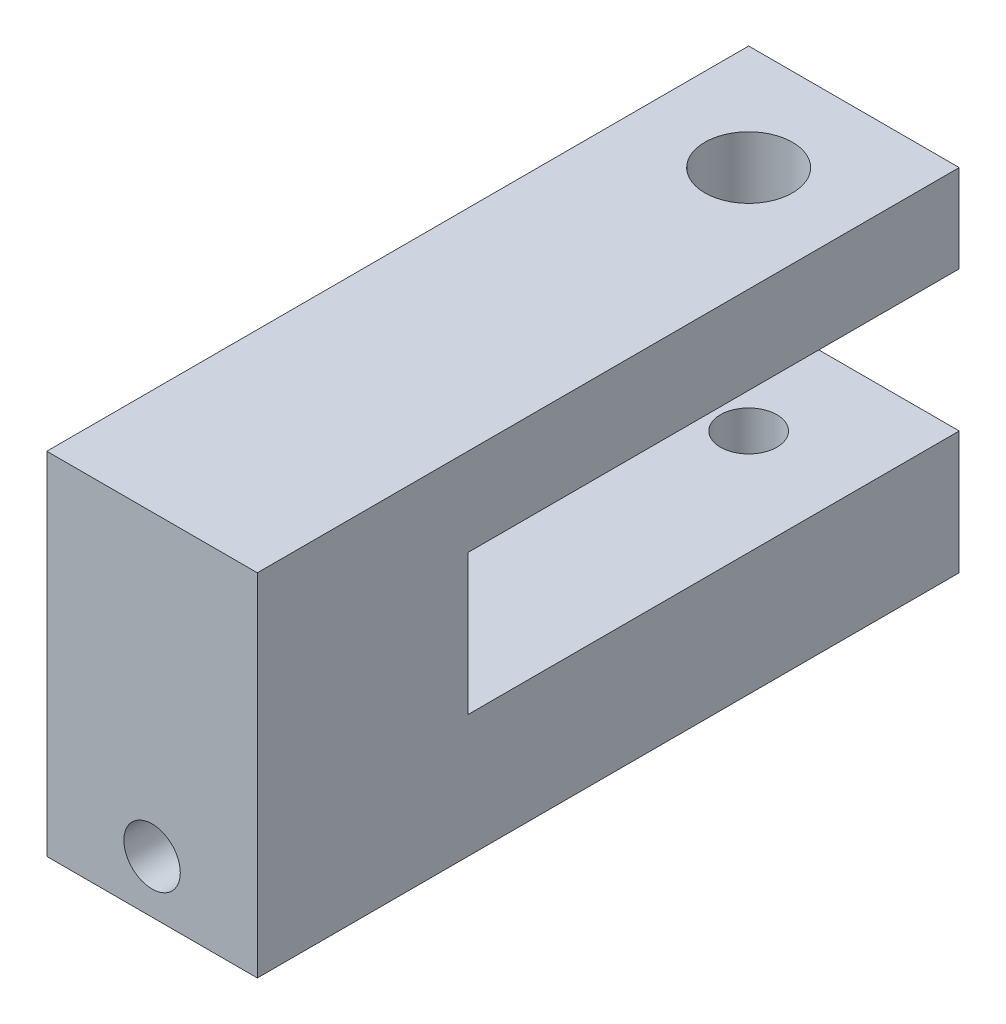
ISO-10303-21;
HEADER;
FILE_DESCRIPTION(('STEP AP214'),'2;1');
FILE_NAME('part.step','',(''),(''),'','','');
FILE_SCHEMA(('AUTOMOTIVE_DESIGN { 1 0 10303 214 1 1 1 1 }'));
ENDSEC;
DATA;
#1=APPLICATION_CONTEXT('core data for automotive mechanical design processes');
#2=APPLICATION_PROTOCOL_DEFINITION('international standard','automotive_design',2000,#1);
#3=PRODUCT_CONTEXT('',#1,'mechanical');
#4=PRODUCT('Part','Part','',(#3));
#5=PRODUCT_RELATED_PRODUCT_CATEGORY('part','',(#4));
#6=PRODUCT_DEFINITION_FORMATION('','',#4);
#7=PRODUCT_DEFINITION_CONTEXT('part definition',#1,'design');
#8=PRODUCT_DEFINITION('design','',#6,#7);
#9=PRODUCT_DEFINITION_SHAPE('','',#8);
#10=(LENGTH_UNIT() NAMED_UNIT(*) SI_UNIT(.MILLI.,.METRE.));
#11=(NAMED_UNIT(*) PLANE_ANGLE_UNIT() SI_UNIT($,.RADIAN.));
#12=(NAMED_UNIT(*) SI_UNIT($,.STERADIAN.) SOLID_ANGLE_UNIT());
#13=UNCERTAINTY_MEASURE_WITH_UNIT(LENGTH_MEASURE(1.E-05),#10,'distance_accuracy_value','');
#14=(GEOMETRIC_REPRESENTATION_CONTEXT(3) GLOBAL_UNCERTAINTY_ASSIGNED_CONTEXT((#13)) GLOBAL_UNIT_ASSIGNED_CONTEXT((#10,
#11,#12)) REPRESENTATION_CONTEXT('',''));
#15=CARTESIAN_POINT('',(0.,0.,0.));
#16=DIRECTION('',(0.,0.,1.));
#17=DIRECTION('',(1.,0.,0.));
#18=AXIS2_PLACEMENT_3D('',#15,#16,#17);
#19=CARTESIAN_POINT('',(9.525,14.2875,-9.525));
#20=DIRECTION('',(0.,-1.,0.));
#21=DIRECTION('',(0.,0.,-1.));
#22=AXIS2_PLACEMENT_3D('',#19,#20,#21);
#23=PLANE('',#22);
#24=CARTESIAN_POINT('',(0.,14.2875,0.));
#25=DIRECTION('',(0.,1.,0.));
#26=DIRECTION('',(0.,0.,1.));
#27=AXIS2_PLACEMENT_3D('',#24,#25,#26);
#28=CIRCLE('',#27,3.96874999999999);
#29=CARTESIAN_POINT('',(0.,14.2875,3.96874999999999));
#30=VERTEX_POINT('',#29);
#31=EDGE_CURVE('E190',#30,#30,#28,.T.);
#32=ORIENTED_EDGE('',*,*,#31,.F.);
#33=EDGE_LOOP('',(#32));
#34=FACE_BOUND('',#33,.T.);
#35=DIRECTION('',(0.,0.,1.));
#36=VECTOR('',#35,1.);
#37=CARTESIAN_POINT('',(-9.525,14.2875,-9.525));
#38=LINE('',#37,#36);
#39=CARTESIAN_POINT('',(-9.525,14.2875,-9.525));
#40=VERTEX_POINT('',#39);
#41=CARTESIAN_POINT('',(-9.525,14.2875,53.975));
#42=VERTEX_POINT('',#41);
#43=EDGE_CURVE('E136',#40,#42,#38,.T.);
#44=ORIENTED_EDGE('',*,*,#43,.T.);
#45=DIRECTION('',(-1.,0.,0.));
#46=VECTOR('',#45,1.);
#47=CARTESIAN_POINT('',(9.525,14.2875,53.975));
#48=LINE('',#47,#46);
#49=CARTESIAN_POINT('',(9.525,14.2875,53.975));
#50=VERTEX_POINT('',#49);
#51=EDGE_CURVE('E11',#50,#42,#48,.T.);
#52=ORIENTED_EDGE('',*,*,#51,.F.);
#53=DIRECTION('',(0.,0.,1.));
#54=VECTOR('',#53,1.);
#55=CARTESIAN_POINT('',(9.525,14.2875,-9.525));
#56=LINE('',#55,#54);
#57=CARTESIAN_POINT('',(9.525,14.2875,-9.525));
#58=VERTEX_POINT('',#57);
#59=EDGE_CURVE('E150',#58,#50,#56,.T.);
#60=ORIENTED_EDGE('',*,*,#59,.F.);
#61=DIRECTION('',(-1.,0.,0.));
#62=VECTOR('',#61,1.);
#63=CARTESIAN_POINT('',(9.525,14.2875,-9.525));
#64=LINE('',#63,#62);
#65=EDGE_CURVE('E132',#58,#40,#64,.T.);
#66=ORIENTED_EDGE('',*,*,#65,.T.);
#67=EDGE_LOOP('',(#44,#52,#60,#66));
#68=FACE_BOUND('',#67,.T.);
#69=ADVANCED_FACE('F37',(#34,#68),#23,.F.);
#70=CARTESIAN_POINT('',(9.525,14.2875,53.975));
#71=DIRECTION('',(0.,0.,-1.));
#72=DIRECTION('',(0.,1.,0.));
#73=AXIS2_PLACEMENT_3D('',#70,#71,#72);
#74=PLANE('',#73);
#75=CARTESIAN_POINT('',(0.,-12.7,53.975));
#76=DIRECTION('',(0.,0.,1.));
#77=DIRECTION('',(1.,0.,0.));
#78=AXIS2_PLACEMENT_3D('',#75,#76,#77);
#79=CIRCLE('',#78,2.55269999999999);
#80=CARTESIAN_POINT('',(2.55269999999999,-12.7,53.975));
#81=VERTEX_POINT('',#80);
#82=EDGE_CURVE('E196',#81,#81,#79,.T.);
#83=ORIENTED_EDGE('',*,*,#82,.F.);
#84=EDGE_LOOP('',(#83));
#85=FACE_BOUND('',#84,.T.);
#86=DIRECTION('',(0.,-1.,0.));
#87=VECTOR('',#86,1.);
#88=CARTESIAN_POINT('',(-9.525,14.2875,53.975));
#89=LINE('',#88,#87);
#90=CARTESIAN_POINT('',(-9.525,-17.4625,53.975));
#91=VERTEX_POINT('',#90);
#92=EDGE_CURVE('E139',#42,#91,#89,.T.);
#93=ORIENTED_EDGE('',*,*,#92,.T.);
#94=DIRECTION('',(-1.,0.,0.));
#95=VECTOR('',#94,1.);
#96=CARTESIAN_POINT('',(9.525,-17.4625,53.975));
#97=LINE('',#96,#95);
#98=CARTESIAN_POINT('',(9.525,-17.4625,53.975));
#99=VERTEX_POINT('',#98);
#100=EDGE_CURVE('E46',#99,#91,#97,.T.);
#101=ORIENTED_EDGE('',*,*,#100,.F.);
#102=DIRECTION('',(0.,-1.,0.));
#103=VECTOR('',#102,1.);
#104=CARTESIAN_POINT('',(9.525,14.2875,53.975));
#105=LINE('',#104,#103);
#106=EDGE_CURVE('E98',#50,#99,#105,.T.);
#107=ORIENTED_EDGE('',*,*,#106,.F.);
#108=ORIENTED_EDGE('',*,*,#51,.T.);
#109=EDGE_LOOP('',(#93,#101,#107,#108));
#110=FACE_BOUND('',#109,.T.);
#111=ADVANCED_FACE('F202',(#85,#110),#74,.F.);
#112=CARTESIAN_POINT('',(9.525,-17.4625,53.975));
#113=DIRECTION('',(0.,1.,0.));
#114=DIRECTION('',(0.,0.,1.));
#115=AXIS2_PLACEMENT_3D('',#112,#113,#114);
#116=PLANE('',#115);
#117=CARTESIAN_POINT('',(0.,-17.4625,0.));
#118=DIRECTION('',(0.,1.,0.));
#119=DIRECTION('',(0.,0.,1.));
#120=AXIS2_PLACEMENT_3D('',#117,#118,#119);
#121=CIRCLE('',#120,2.5527);
#122=CARTESIAN_POINT('',(0.,-17.4625,2.55269999999999));
#123=VERTEX_POINT('',#122);
#124=EDGE_CURVE('E184',#123,#123,#121,.T.);
#125=ORIENTED_EDGE('',*,*,#124,.T.);
#126=EDGE_LOOP('',(#125));
#127=FACE_BOUND('',#126,.T.);
#128=DIRECTION('',(0.,0.,-1.));
#129=VECTOR('',#128,1.);
#130=CARTESIAN_POINT('',(-9.525,-17.4625,53.975));
#131=LINE('',#130,#129);
#132=CARTESIAN_POINT('',(-9.525,-17.4625,-9.525));
#133=VERTEX_POINT('',#132);
#134=EDGE_CURVE('E141',#91,#133,#131,.T.);
#135=ORIENTED_EDGE('',*,*,#134,.T.);
#136=DIRECTION('',(-1.,0.,0.));
#137=VECTOR('',#136,1.);
#138=CARTESIAN_POINT('',(9.525,-17.4625,-9.525));
#139=LINE('',#138,#137);
#140=CARTESIAN_POINT('',(9.525,-17.4625,-9.525));
#141=VERTEX_POINT('',#140);
#142=EDGE_CURVE('E157',#141,#133,#139,.T.);
#143=ORIENTED_EDGE('',*,*,#142,.F.);
#144=DIRECTION('',(0.,0.,-1.));
#145=VECTOR('',#144,1.);
#146=CARTESIAN_POINT('',(9.525,-17.4625,53.975));
#147=LINE('',#146,#145);
#148=EDGE_CURVE('E166',#99,#141,#147,.T.);
#149=ORIENTED_EDGE('',*,*,#148,.F.);
#150=ORIENTED_EDGE('',*,*,#100,.T.);
#151=EDGE_LOOP('',(#135,#143,#149,#150));
#152=FACE_BOUND('',#151,.T.);
#153=ADVANCED_FACE('F164',(#127,#152),#116,.F.);
#154=CARTESIAN_POINT('',(9.525,-17.4625,-9.525));
#155=DIRECTION('',(0.,0.,1.));
#156=DIRECTION('',(1.,0.,0.));
#157=AXIS2_PLACEMENT_3D('',#154,#155,#156);
#158=PLANE('',#157);
#159=DIRECTION('',(0.,1.,0.));
#160=VECTOR('',#159,1.);
#161=CARTESIAN_POINT('',(-9.525,-17.4625,-9.525));
#162=LINE('',#161,#160);
#163=CARTESIAN_POINT('',(-9.525,-6.35,-9.525));
#164=VERTEX_POINT('',#163);
#165=EDGE_CURVE('E143',#133,#164,#162,.T.);
#166=ORIENTED_EDGE('',*,*,#165,.T.);
#167=DIRECTION('',(-1.,0.,0.));
#168=VECTOR('',#167,1.);
#169=CARTESIAN_POINT('',(9.525,-6.35,-9.525));
#170=LINE('',#169,#168);
#171=CARTESIAN_POINT('',(9.525,-6.35,-9.525));
#172=VERTEX_POINT('',#171);
#173=EDGE_CURVE('E154',#172,#164,#170,.T.);
#174=ORIENTED_EDGE('',*,*,#173,.F.);
#175=DIRECTION('',(0.,1.,0.));
#176=VECTOR('',#175,1.);
#177=CARTESIAN_POINT('',(9.525,-17.4625,-9.525));
#178=LINE('',#177,#176);
#179=EDGE_CURVE('E178',#141,#172,#178,.T.);
#180=ORIENTED_EDGE('',*,*,#179,.F.);
#181=ORIENTED_EDGE('',*,*,#142,.T.);
#182=EDGE_LOOP('',(#166,#174,#180,#181));
#183=FACE_BOUND('',#182,.T.);
#184=ADVANCED_FACE('F174',(#183),#158,.F.);
#185=CARTESIAN_POINT('',(9.525,-6.35,-9.525));
#186=DIRECTION('',(0.,-1.,0.));
#187=DIRECTION('',(0.,0.,-1.));
#188=AXIS2_PLACEMENT_3D('',#185,#186,#187);
#189=PLANE('',#188);
#190=CARTESIAN_POINT('',(0.,-6.35,0.));
#191=DIRECTION('',(0.,-1.,0.));
#192=DIRECTION('',(0.,0.,-1.));
#193=AXIS2_PLACEMENT_3D('',#190,#191,#192);
#194=CIRCLE('',#193,2.5527);
#195=CARTESIAN_POINT('',(0.,-6.35,-2.5527));
#196=VERTEX_POINT('',#195);
#197=EDGE_CURVE('E40',#196,#196,#194,.T.);
#198=ORIENTED_EDGE('',*,*,#197,.T.);
#199=EDGE_LOOP('',(#198));
#200=FACE_BOUND('',#199,.T.);
#201=DIRECTION('',(0.,0.,1.));
#202=VECTOR('',#201,1.);
#203=CARTESIAN_POINT('',(-9.525,-6.35,-9.525));
#204=LINE('',#203,#202);
#205=CARTESIAN_POINT('',(-9.525,-6.35,34.925));
#206=VERTEX_POINT('',#205);
#207=EDGE_CURVE('E145',#164,#206,#204,.T.);
#208=ORIENTED_EDGE('',*,*,#207,.T.);
#209=DIRECTION('',(-1.,0.,0.));
#210=VECTOR('',#209,1.);
#211=CARTESIAN_POINT('',(9.525,-6.35,34.925));
#212=LINE('',#211,#210);
#213=CARTESIAN_POINT('',(9.525,-6.35,34.925));
#214=VERTEX_POINT('',#213);
#215=EDGE_CURVE('E127',#214,#206,#212,.T.);
#216=ORIENTED_EDGE('',*,*,#215,.F.);
#217=DIRECTION('',(0.,0.,1.));
#218=VECTOR('',#217,1.);
#219=CARTESIAN_POINT('',(9.525,-6.35,-9.525));
#220=LINE('',#219,#218);
#221=EDGE_CURVE('E118',#172,#214,#220,.T.);
#222=ORIENTED_EDGE('',*,*,#221,.F.);
#223=ORIENTED_EDGE('',*,*,#173,.T.);
#224=EDGE_LOOP('',(#208,#216,#222,#223));
#225=FACE_BOUND('',#224,.T.);
#226=ADVANCED_FACE('F177',(#200,#225),#189,.F.);
#227=CARTESIAN_POINT('',(9.525,-6.35,34.925));
#228=DIRECTION('',(0.,0.,1.));
#229=DIRECTION('',(1.,0.,0.));
#230=AXIS2_PLACEMENT_3D('',#227,#228,#229);
#231=PLANE('',#230);
#232=DIRECTION('',(0.,1.,0.));
#233=VECTOR('',#232,1.);
#234=CARTESIAN_POINT('',(-9.525,-6.35,34.925));
#235=LINE('',#234,#233);
#236=CARTESIAN_POINT('',(-9.525,6.35,34.925));
#237=VERTEX_POINT('',#236);
#238=EDGE_CURVE('E126',#206,#237,#235,.T.);
#239=ORIENTED_EDGE('',*,*,#238,.T.);
#240=DIRECTION('',(-1.,0.,0.));
#241=VECTOR('',#240,1.);
#242=CARTESIAN_POINT('',(9.525,6.35,34.925));
#243=LINE('',#242,#241);
#244=CARTESIAN_POINT('',(9.525,6.35,34.925));
#245=VERTEX_POINT('',#244);
#246=EDGE_CURVE('E123',#245,#237,#243,.T.);
#247=ORIENTED_EDGE('',*,*,#246,.F.);
#248=DIRECTION('',(0.,1.,0.));
#249=VECTOR('',#248,1.);
#250=CARTESIAN_POINT('',(9.525,-6.35,34.925));
#251=LINE('',#250,#249);
#252=EDGE_CURVE('E112',#214,#245,#251,.T.);
#253=ORIENTED_EDGE('',*,*,#252,.F.);
#254=ORIENTED_EDGE('',*,*,#215,.T.);
#255=EDGE_LOOP('',(#239,#247,#253,#254));
#256=FACE_BOUND('',#255,.T.);
#257=ADVANCED_FACE('F124',(#256),#231,.F.);
#258=CARTESIAN_POINT('',(9.525,6.35,34.925));
#259=DIRECTION('',(0.,1.,0.));
#260=DIRECTION('',(0.,0.,1.));
#261=AXIS2_PLACEMENT_3D('',#258,#259,#260);
#262=PLANE('',#261);
#263=CARTESIAN_POINT('',(0.,6.35,0.));
#264=DIRECTION('',(0.,1.,0.));
#265=DIRECTION('',(0.,0.,1.));
#266=AXIS2_PLACEMENT_3D('',#263,#264,#265);
#267=CIRCLE('',#266,3.96874999999999);
#268=CARTESIAN_POINT('',(0.,6.35,3.96874999999999));
#269=VERTEX_POINT('',#268);
#270=EDGE_CURVE('E187',#269,#269,#267,.T.);
#271=ORIENTED_EDGE('',*,*,#270,.T.);
#272=EDGE_LOOP('',(#271));
#273=FACE_BOUND('',#272,.T.);
#274=DIRECTION('',(0.,0.,-1.));
#275=VECTOR('',#274,1.);
#276=CARTESIAN_POINT('',(-9.525,6.35,34.925));
#277=LINE('',#276,#275);
#278=CARTESIAN_POINT('',(-9.525,6.35,-9.525));
#279=VERTEX_POINT('',#278);
#280=EDGE_CURVE('E84',#237,#279,#277,.T.);
#281=ORIENTED_EDGE('',*,*,#280,.T.);
#282=DIRECTION('',(-1.,0.,0.));
#283=VECTOR('',#282,1.);
#284=CARTESIAN_POINT('',(9.525,6.35,-9.525));
#285=LINE('',#284,#283);
#286=CARTESIAN_POINT('',(9.525,6.35,-9.525));
#287=VERTEX_POINT('',#286);
#288=EDGE_CURVE('E128',#287,#279,#285,.T.);
#289=ORIENTED_EDGE('',*,*,#288,.F.);
#290=DIRECTION('',(0.,0.,-1.));
#291=VECTOR('',#290,1.);
#292=CARTESIAN_POINT('',(9.525,6.35,34.925));
#293=LINE('',#292,#291);
#294=EDGE_CURVE('E116',#245,#287,#293,.T.);
#295=ORIENTED_EDGE('',*,*,#294,.F.);
#296=ORIENTED_EDGE('',*,*,#246,.T.);
#297=EDGE_LOOP('',(#281,#289,#295,#296));
#298=FACE_BOUND('',#297,.T.);
#299=ADVANCED_FACE('F130',(#273,#298),#262,.F.);
#300=CARTESIAN_POINT('',(9.525,6.35,-9.525));
#301=DIRECTION('',(0.,0.,1.));
#302=DIRECTION('',(0.,-1.,0.));
#303=AXIS2_PLACEMENT_3D('',#300,#301,#302);
#304=PLANE('',#303);
#305=DIRECTION('',(0.,1.,0.));
#306=VECTOR('',#305,1.);
#307=CARTESIAN_POINT('',(-9.525,6.35,-9.525));
#308=LINE('',#307,#306);
#309=EDGE_CURVE('E90',#279,#40,#308,.T.);
#310=ORIENTED_EDGE('',*,*,#309,.T.);
#311=ORIENTED_EDGE('',*,*,#65,.F.);
#312=DIRECTION('',(0.,1.,0.));
#313=VECTOR('',#312,1.);
#314=CARTESIAN_POINT('',(9.525,6.35,-9.525));
#315=LINE('',#314,#313);
#316=EDGE_CURVE('E54',#287,#58,#315,.T.);
#317=ORIENTED_EDGE('',*,*,#316,.F.);
#318=ORIENTED_EDGE('',*,*,#288,.T.);
#319=EDGE_LOOP('',(#310,#311,#317,#318));
#320=FACE_BOUND('',#319,.T.);
#321=ADVANCED_FACE('F207',(#320),#304,.F.);
#322=CARTESIAN_POINT('',(9.525,0.,0.));
#323=DIRECTION('',(1.,0.,0.));
#324=DIRECTION('',(0.,0.,-1.));
#325=AXIS2_PLACEMENT_3D('',#322,#323,#324);
#326=PLANE('',#325);
#327=ORIENTED_EDGE('',*,*,#59,.T.);
#328=ORIENTED_EDGE('',*,*,#106,.T.);
#329=ORIENTED_EDGE('',*,*,#148,.T.);
#330=ORIENTED_EDGE('',*,*,#179,.T.);
#331=ORIENTED_EDGE('',*,*,#221,.T.);
#332=ORIENTED_EDGE('',*,*,#252,.T.);
#333=ORIENTED_EDGE('',*,*,#294,.T.);
#334=ORIENTED_EDGE('',*,*,#316,.T.);
#335=EDGE_LOOP('',(#327,#328,#329,#330,#331,#332,#333,#334));
#336=FACE_BOUND('',#335,.T.);
#337=ADVANCED_FACE('F114',(#336),#326,.T.);
#338=CARTESIAN_POINT('',(-9.525,0.,0.));
#339=DIRECTION('',(1.,0.,0.));
#340=DIRECTION('',(0.,0.,-1.));
#341=AXIS2_PLACEMENT_3D('',#338,#339,#340);
#342=PLANE('',#341);
#343=ORIENTED_EDGE('',*,*,#43,.F.);
#344=ORIENTED_EDGE('',*,*,#309,.F.);
#345=ORIENTED_EDGE('',*,*,#280,.F.);
#346=ORIENTED_EDGE('',*,*,#238,.F.);
#347=ORIENTED_EDGE('',*,*,#207,.F.);
#348=ORIENTED_EDGE('',*,*,#165,.F.);
#349=ORIENTED_EDGE('',*,*,#134,.F.);
#350=ORIENTED_EDGE('',*,*,#92,.F.);
#351=EDGE_LOOP('',(#343,#344,#345,#346,#347,#348,#349,#350));
#352=FACE_BOUND('',#351,.T.);
#353=ADVANCED_FACE('F170',(#352),#342,.F.);
#354=CARTESIAN_POINT('',(0.,14.2875,0.));
#355=DIRECTION('',(0.,1.,0.));
#356=DIRECTION('',(0.,0.,1.));
#357=AXIS2_PLACEMENT_3D('',#354,#355,#356);
#358=CYLINDRICAL_SURFACE('',#357,2.5527);
#359=ORIENTED_EDGE('',*,*,#124,.F.);
#360=EDGE_LOOP('',(#359));
#361=FACE_BOUND('',#360,.T.);
#362=ORIENTED_EDGE('',*,*,#197,.F.);
#363=EDGE_LOOP('',(#362));
#364=FACE_BOUND('',#363,.T.);
#365=ADVANCED_FACE('F229',(#361,#364),#358,.F.);
#366=CARTESIAN_POINT('',(0.,14.2875,0.));
#367=DIRECTION('',(0.,1.,0.));
#368=DIRECTION('',(0.,0.,1.));
#369=AXIS2_PLACEMENT_3D('',#366,#367,#368);
#370=CYLINDRICAL_SURFACE('',#369,3.96874999999999);
#371=ORIENTED_EDGE('',*,*,#31,.T.);
#372=EDGE_LOOP('',(#371));
#373=FACE_BOUND('',#372,.T.);
#374=ORIENTED_EDGE('',*,*,#270,.F.);
#375=EDGE_LOOP('',(#374));
#376=FACE_BOUND('',#375,.T.);
#377=ADVANCED_FACE('F225',(#373,#376),#370,.F.);
#378=CARTESIAN_POINT('',(0.,-12.7,37.465));
#379=DIRECTION('',(0.,0.,1.));
#380=DIRECTION('',(1.,0.,0.));
#381=AXIS2_PLACEMENT_3D('',#378,#379,#380);
#382=CONICAL_SURFACE('',#381,2.55269999999999,1.02974425867665);
#383=CARTESIAN_POINT('',(0.,-12.7,35.9311830978084));
#384=VERTEX_POINT('',#383);
#385=VERTEX_LOOP('',#384);
#386=FACE_BOUND('',#385,.T.);
#387=CARTESIAN_POINT('',(0.,-12.7,37.465));
#388=DIRECTION('',(0.,0.,1.));
#389=DIRECTION('',(1.,0.,0.));
#390=AXIS2_PLACEMENT_3D('',#387,#388,#389);
#391=CIRCLE('',#390,2.55269999999999);
#392=CARTESIAN_POINT('',(2.55269999999999,-12.7,37.465));
#393=VERTEX_POINT('',#392);
#394=EDGE_CURVE('E193',#393,#393,#391,.T.);
#395=ORIENTED_EDGE('',*,*,#394,.T.);
#396=EDGE_LOOP('',(#395));
#397=FACE_BOUND('',#396,.T.);
#398=ADVANCED_FACE('F228',(#386,#397),#382,.F.);
#399=CARTESIAN_POINT('',(0.,-12.7,53.975));
#400=DIRECTION('',(0.,0.,1.));
#401=DIRECTION('',(1.,0.,0.));
#402=AXIS2_PLACEMENT_3D('',#399,#400,#401);
#403=CYLINDRICAL_SURFACE('',#402,2.55269999999999);
#404=ORIENTED_EDGE('',*,*,#394,.F.);
#405=EDGE_LOOP('',(#404));
#406=FACE_BOUND('',#405,.T.);
#407=ORIENTED_EDGE('',*,*,#82,.T.);
#408=EDGE_LOOP('',(#407));
#409=FACE_BOUND('',#408,.T.);
#410=ADVANCED_FACE('F200',(#406,#409),#403,.F.);
#411=CLOSED_SHELL('',(#69,#111,#153,#184,#226,#257,#299,#321,#337,#353,#365,#377,#398,#410));
#412=MANIFOLD_SOLID_BREP('B2',#411);
#413=ADVANCED_BREP_SHAPE_REPRESENTATION('',(#18,#412),#14);
#414=SHAPE_DEFINITION_REPRESENTATION(#9,#413);
ENDSEC;
END-ISO-10303-21;
